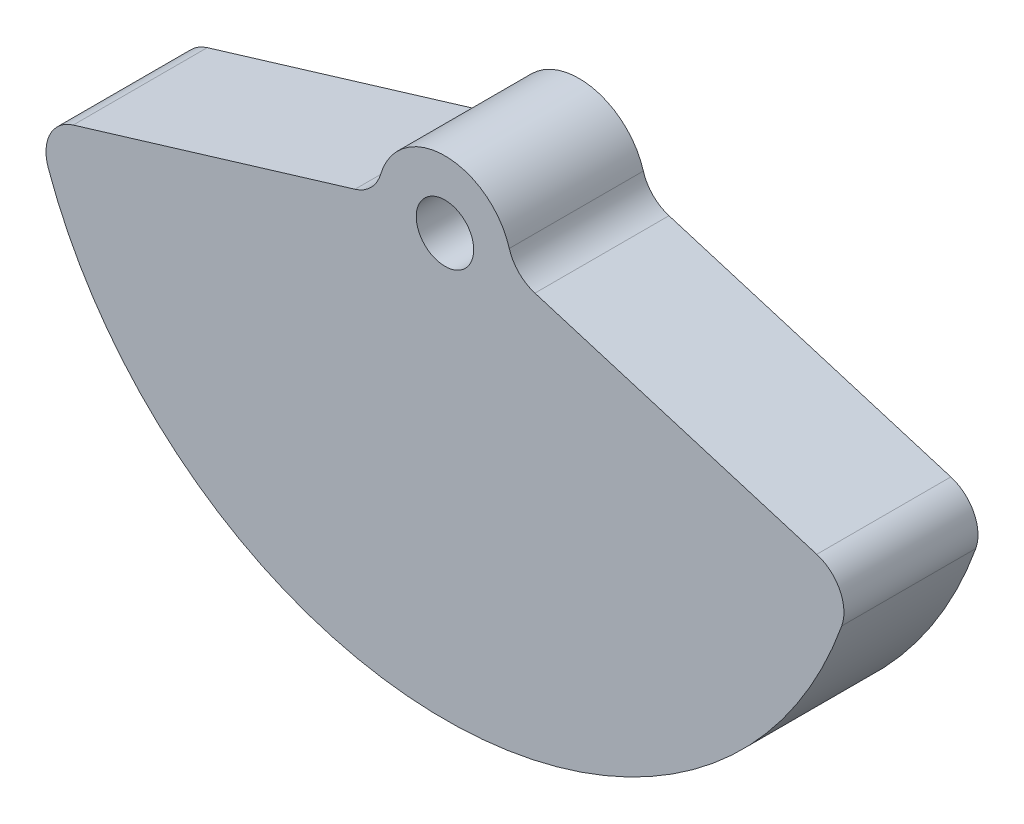
ISO-10303-21;
HEADER;
FILE_DESCRIPTION(('STEP AP214'),'2;1');
FILE_NAME('part.step','',(''),(''),'','','');
FILE_SCHEMA(('AUTOMOTIVE_DESIGN { 1 0 10303 214 1 1 1 1 }'));
ENDSEC;
DATA;
#1=APPLICATION_CONTEXT('core data for automotive mechanical design processes');
#2=APPLICATION_PROTOCOL_DEFINITION('international standard','automotive_design',2000,#1);
#3=PRODUCT_CONTEXT('',#1,'mechanical');
#4=PRODUCT('Part','Part','',(#3));
#5=PRODUCT_RELATED_PRODUCT_CATEGORY('part','',(#4));
#6=PRODUCT_DEFINITION_FORMATION('','',#4);
#7=PRODUCT_DEFINITION_CONTEXT('part definition',#1,'design');
#8=PRODUCT_DEFINITION('design','',#6,#7);
#9=PRODUCT_DEFINITION_SHAPE('','',#8);
#10=(LENGTH_UNIT() NAMED_UNIT(*) SI_UNIT(.MILLI.,.METRE.));
#11=(NAMED_UNIT(*) PLANE_ANGLE_UNIT() SI_UNIT($,.RADIAN.));
#12=(NAMED_UNIT(*) SI_UNIT($,.STERADIAN.) SOLID_ANGLE_UNIT());
#13=UNCERTAINTY_MEASURE_WITH_UNIT(LENGTH_MEASURE(1.E-05),#10,'distance_accuracy_value','');
#14=(GEOMETRIC_REPRESENTATION_CONTEXT(3) GLOBAL_UNCERTAINTY_ASSIGNED_CONTEXT((#13)) GLOBAL_UNIT_ASSIGNED_CONTEXT((#10,
#11,#12)) REPRESENTATION_CONTEXT('',''));
#15=CARTESIAN_POINT('',(0.,0.,0.));
#16=DIRECTION('',(0.,0.,1.));
#17=DIRECTION('',(1.,0.,0.));
#18=AXIS2_PLACEMENT_3D('',#15,#16,#17);
#19=CARTESIAN_POINT('',(5.58432736770412,1.64237283975204,3.70416666666667));
#20=DIRECTION('',(0.,0.,-1.));
#21=DIRECTION('',(-1.,0.,0.));
#22=AXIS2_PLACEMENT_3D('',#19,#20,#21);
#23=PLANE('',#22);
#24=CARTESIAN_POINT('',(5.58432736770412,1.64237283975204,3.70416666666667));
#25=DIRECTION('',(0.,0.,-1.));
#26=DIRECTION('',(-1.,0.,0.));
#27=AXIS2_PLACEMENT_3D('',#24,#25,#26);
#28=CIRCLE('',#27,2.11666666666667);
#29=CARTESIAN_POINT('',(4.971067319684,-0.383507189094712,3.70416666666667));
#30=VERTEX_POINT('',#29);
#31=CARTESIAN_POINT('',(3.55366287035717,1.04514635256948,3.70416666666667));
#32=VERTEX_POINT('',#31);
#33=EDGE_CURVE('E145',#30,#32,#28,.T.);
#34=ORIENTED_EDGE('',*,*,#33,.T.);
#35=CARTESIAN_POINT('',(0.,0.,3.70416666666667));
#36=DIRECTION('',(0.,0.,1.));
#37=DIRECTION('',(1.,0.,0.));
#38=AXIS2_PLACEMENT_3D('',#35,#36,#37);
#39=CIRCLE('',#38,3.70416666666667);
#40=CARTESIAN_POINT('',(-3.55366287035717,1.04514635256948,3.70416666666667));
#41=VERTEX_POINT('',#40);
#42=EDGE_CURVE('E93',#32,#41,#39,.T.);
#43=ORIENTED_EDGE('',*,*,#42,.T.);
#44=CARTESIAN_POINT('',(-5.58432736770412,1.64237283975204,3.70416666666667));
#45=DIRECTION('',(0.,0.,-1.));
#46=DIRECTION('',(1.,0.,0.));
#47=AXIS2_PLACEMENT_3D('',#44,#45,#46);
#48=CIRCLE('',#47,2.11666666666667);
#49=CARTESIAN_POINT('',(-4.971067319684,-0.383507189094713,3.70416666666667));
#50=VERTEX_POINT('',#49);
#51=EDGE_CURVE('E160',#41,#50,#48,.T.);
#52=ORIENTED_EDGE('',*,*,#51,.T.);
#53=DIRECTION('',(-0.957108675045711,-0.289729156544941,0.));
#54=VECTOR('',#53,1.);
#55=CARTESIAN_POINT('',(-20.5451073112575,-5.09797022594919,3.70416666666667));
#56=LINE('',#55,#54);
#57=CARTESIAN_POINT('',(-20.5451073112575,-5.09797022594919,3.70416666666667));
#58=VERTEX_POINT('',#57);
#59=EDGE_CURVE('E173',#50,#58,#56,.T.);
#60=ORIENTED_EDGE('',*,*,#59,.T.);
#61=CARTESIAN_POINT('',(-19.9318472632373,-7.12385025479595,3.70416666666667));
#62=DIRECTION('',(0.,0.,1.));
#63=DIRECTION('',(1.,0.,0.));
#64=AXIS2_PLACEMENT_3D('',#61,#62,#63);
#65=CIRCLE('',#64,2.11666666666666);
#66=CARTESIAN_POINT('',(-21.9250319895611,-7.83623528027554,3.70416666666667));
#67=VERTEX_POINT('',#66);
#68=EDGE_CURVE('E112',#58,#67,#65,.T.);
#69=ORIENTED_EDGE('',*,*,#68,.T.);
#70=CARTESIAN_POINT('',(0.,0.,3.70416666666667));
#71=DIRECTION('',(0.,0.,1.));
#72=DIRECTION('',(1.,0.,0.));
#73=AXIS2_PLACEMENT_3D('',#70,#71,#72);
#74=CIRCLE('',#73,23.2833333333333);
#75=CARTESIAN_POINT('',(21.9250319895611,-7.83623528027554,3.70416666666667));
#76=VERTEX_POINT('',#75);
#77=EDGE_CURVE('E106',#67,#76,#74,.T.);
#78=ORIENTED_EDGE('',*,*,#77,.T.);
#79=CARTESIAN_POINT('',(19.9318472632373,-7.12385025479594,3.70416666666667));
#80=DIRECTION('',(0.,0.,1.));
#81=DIRECTION('',(-1.,0.,0.));
#82=AXIS2_PLACEMENT_3D('',#79,#80,#81);
#83=CIRCLE('',#82,2.11666666666666);
#84=CARTESIAN_POINT('',(20.5451073112575,-5.09797022594918,3.70416666666667));
#85=VERTEX_POINT('',#84);
#86=EDGE_CURVE('E110',#76,#85,#83,.T.);
#87=ORIENTED_EDGE('',*,*,#86,.T.);
#88=DIRECTION('',(-0.957108675045711,0.289729156544941,0.));
#89=VECTOR('',#88,1.);
#90=CARTESIAN_POINT('',(4.971067319684,-0.383507189094712,3.70416666666667));
#91=LINE('',#90,#89);
#92=EDGE_CURVE('E50',#85,#30,#91,.T.);
#93=ORIENTED_EDGE('',*,*,#92,.T.);
#94=EDGE_LOOP('',(#34,#43,#52,#60,#69,#78,#87,#93));
#95=FACE_BOUND('',#94,.T.);
#96=CARTESIAN_POINT('',(0.,0.,3.70416666666667));
#97=DIRECTION('',(0.,0.,1.));
#98=DIRECTION('',(1.,0.,0.));
#99=AXIS2_PLACEMENT_3D('',#96,#97,#98);
#100=CIRCLE('',#99,1.5875);
#101=CARTESIAN_POINT('',(1.5875,0.,3.70416666666667));
#102=VERTEX_POINT('',#101);
#103=EDGE_CURVE('E134',#102,#102,#100,.T.);
#104=ORIENTED_EDGE('',*,*,#103,.F.);
#105=EDGE_LOOP('',(#104));
#106=FACE_BOUND('',#105,.T.);
#107=ADVANCED_FACE('F33',(#95,#106),#23,.F.);
#108=CARTESIAN_POINT('',(5.58432736770412,1.64237283975204,-3.70416666666667));
#109=DIRECTION('',(0.,0.,-1.));
#110=DIRECTION('',(-1.,0.,0.));
#111=AXIS2_PLACEMENT_3D('',#108,#109,#110);
#112=PLANE('',#111);
#113=CARTESIAN_POINT('',(5.58432736770412,1.64237283975204,-3.70416666666667));
#114=DIRECTION('',(0.,0.,-1.));
#115=DIRECTION('',(-1.,0.,0.));
#116=AXIS2_PLACEMENT_3D('',#113,#114,#115);
#117=CIRCLE('',#116,2.11666666666667);
#118=CARTESIAN_POINT('',(4.971067319684,-0.383507189094712,-3.70416666666667));
#119=VERTEX_POINT('',#118);
#120=CARTESIAN_POINT('',(3.55366287035717,1.04514635256948,-3.70416666666667));
#121=VERTEX_POINT('',#120);
#122=EDGE_CURVE('E130',#119,#121,#117,.T.);
#123=ORIENTED_EDGE('',*,*,#122,.F.);
#124=DIRECTION('',(-0.957108675045711,0.289729156544941,0.));
#125=VECTOR('',#124,1.);
#126=CARTESIAN_POINT('',(4.971067319684,-0.383507189094712,-3.70416666666667));
#127=LINE('',#126,#125);
#128=CARTESIAN_POINT('',(20.5451073112575,-5.09797022594918,-3.70416666666667));
#129=VERTEX_POINT('',#128);
#130=EDGE_CURVE('E85',#129,#119,#127,.T.);
#131=ORIENTED_EDGE('',*,*,#130,.F.);
#132=CARTESIAN_POINT('',(19.9318472632373,-7.12385025479594,-3.70416666666667));
#133=DIRECTION('',(0.,0.,1.));
#134=DIRECTION('',(-1.,0.,0.));
#135=AXIS2_PLACEMENT_3D('',#132,#133,#134);
#136=CIRCLE('',#135,2.11666666666666);
#137=CARTESIAN_POINT('',(21.9250319895611,-7.83623528027554,-3.70416666666667));
#138=VERTEX_POINT('',#137);
#139=EDGE_CURVE('E79',#138,#129,#136,.T.);
#140=ORIENTED_EDGE('',*,*,#139,.F.);
#141=CARTESIAN_POINT('',(0.,0.,-3.70416666666667));
#142=DIRECTION('',(0.,0.,1.));
#143=DIRECTION('',(1.,0.,0.));
#144=AXIS2_PLACEMENT_3D('',#141,#142,#143);
#145=CIRCLE('',#144,23.2833333333333);
#146=CARTESIAN_POINT('',(-21.9250319895611,-7.83623528027554,-3.70416666666667));
#147=VERTEX_POINT('',#146);
#148=EDGE_CURVE('E120',#147,#138,#145,.T.);
#149=ORIENTED_EDGE('',*,*,#148,.F.);
#150=CARTESIAN_POINT('',(-19.9318472632373,-7.12385025479595,-3.70416666666667));
#151=DIRECTION('',(0.,0.,1.));
#152=DIRECTION('',(1.,0.,0.));
#153=AXIS2_PLACEMENT_3D('',#150,#151,#152);
#154=CIRCLE('',#153,2.11666666666666);
#155=CARTESIAN_POINT('',(-20.5451073112575,-5.09797022594919,-3.70416666666667));
#156=VERTEX_POINT('',#155);
#157=EDGE_CURVE('E140',#156,#147,#154,.T.);
#158=ORIENTED_EDGE('',*,*,#157,.F.);
#159=DIRECTION('',(-0.957108675045711,-0.289729156544941,0.));
#160=VECTOR('',#159,1.);
#161=CARTESIAN_POINT('',(-20.5451073112575,-5.09797022594919,-3.70416666666667));
#162=LINE('',#161,#160);
#163=CARTESIAN_POINT('',(-4.971067319684,-0.383507189094713,-3.70416666666667));
#164=VERTEX_POINT('',#163);
#165=EDGE_CURVE('E138',#164,#156,#162,.T.);
#166=ORIENTED_EDGE('',*,*,#165,.F.);
#167=CARTESIAN_POINT('',(-5.58432736770412,1.64237283975204,-3.70416666666667));
#168=DIRECTION('',(0.,0.,-1.));
#169=DIRECTION('',(1.,0.,0.));
#170=AXIS2_PLACEMENT_3D('',#167,#168,#169);
#171=CIRCLE('',#170,2.11666666666667);
#172=CARTESIAN_POINT('',(-3.55366287035717,1.04514635256948,-3.70416666666667));
#173=VERTEX_POINT('',#172);
#174=EDGE_CURVE('E136',#173,#164,#171,.T.);
#175=ORIENTED_EDGE('',*,*,#174,.F.);
#176=CARTESIAN_POINT('',(0.,0.,-3.70416666666667));
#177=DIRECTION('',(0.,0.,1.));
#178=DIRECTION('',(1.,0.,0.));
#179=AXIS2_PLACEMENT_3D('',#176,#177,#178);
#180=CIRCLE('',#179,3.70416666666667);
#181=EDGE_CURVE('E133',#121,#173,#180,.T.);
#182=ORIENTED_EDGE('',*,*,#181,.F.);
#183=EDGE_LOOP('',(#123,#131,#140,#149,#158,#166,#175,#182));
#184=FACE_BOUND('',#183,.T.);
#185=CARTESIAN_POINT('',(0.,0.,-3.70416666666667));
#186=DIRECTION('',(0.,0.,1.));
#187=DIRECTION('',(1.,0.,0.));
#188=AXIS2_PLACEMENT_3D('',#185,#186,#187);
#189=CIRCLE('',#188,1.5875);
#190=CARTESIAN_POINT('',(1.5875,0.,-3.70416666666667));
#191=VERTEX_POINT('',#190);
#192=EDGE_CURVE('E179',#191,#191,#189,.T.);
#193=ORIENTED_EDGE('',*,*,#192,.T.);
#194=EDGE_LOOP('',(#193));
#195=FACE_BOUND('',#194,.T.);
#196=ADVANCED_FACE('F164',(#184,#195),#112,.T.);
#197=CARTESIAN_POINT('',(5.58432736770412,1.64237283975204,3.70416666666667));
#198=DIRECTION('',(0.,0.,-1.));
#199=DIRECTION('',(-1.,0.,0.));
#200=AXIS2_PLACEMENT_3D('',#197,#198,#199);
#201=CYLINDRICAL_SURFACE('',#200,2.11666666666667);
#202=ORIENTED_EDGE('',*,*,#122,.T.);
#203=DIRECTION('',(0.,0.,-1.));
#204=VECTOR('',#203,1.);
#205=CARTESIAN_POINT('',(3.55366287035717,1.04514635256948,3.70416666666667));
#206=LINE('',#205,#204);
#207=EDGE_CURVE('E11',#32,#121,#206,.T.);
#208=ORIENTED_EDGE('',*,*,#207,.F.);
#209=ORIENTED_EDGE('',*,*,#33,.F.);
#210=DIRECTION('',(0.,0.,-1.));
#211=VECTOR('',#210,1.);
#212=CARTESIAN_POINT('',(4.971067319684,-0.383507189094712,3.70416666666667));
#213=LINE('',#212,#211);
#214=EDGE_CURVE('E126',#30,#119,#213,.T.);
#215=ORIENTED_EDGE('',*,*,#214,.T.);
#216=EDGE_LOOP('',(#202,#208,#209,#215));
#217=FACE_BOUND('',#216,.T.);
#218=ADVANCED_FACE('F35',(#217),#201,.F.);
#219=CARTESIAN_POINT('',(0.,0.,3.70416666666667));
#220=DIRECTION('',(0.,0.,-1.));
#221=DIRECTION('',(-1.,0.,0.));
#222=AXIS2_PLACEMENT_3D('',#219,#220,#221);
#223=CYLINDRICAL_SURFACE('',#222,3.70416666666667);
#224=ORIENTED_EDGE('',*,*,#181,.T.);
#225=DIRECTION('',(0.,0.,-1.));
#226=VECTOR('',#225,1.);
#227=CARTESIAN_POINT('',(-3.55366287035717,1.04514635256948,3.70416666666667));
#228=LINE('',#227,#226);
#229=EDGE_CURVE('E42',#41,#173,#228,.T.);
#230=ORIENTED_EDGE('',*,*,#229,.F.);
#231=ORIENTED_EDGE('',*,*,#42,.F.);
#232=ORIENTED_EDGE('',*,*,#207,.T.);
#233=EDGE_LOOP('',(#224,#230,#231,#232));
#234=FACE_BOUND('',#233,.T.);
#235=ADVANCED_FACE('F207',(#234),#223,.T.);
#236=CARTESIAN_POINT('',(-5.58432736770412,1.64237283975204,3.70416666666667));
#237=DIRECTION('',(0.,0.,-1.));
#238=DIRECTION('',(-1.,0.,0.));
#239=AXIS2_PLACEMENT_3D('',#236,#237,#238);
#240=CYLINDRICAL_SURFACE('',#239,2.11666666666667);
#241=ORIENTED_EDGE('',*,*,#174,.T.);
#242=DIRECTION('',(0.,0.,-1.));
#243=VECTOR('',#242,1.);
#244=CARTESIAN_POINT('',(-4.971067319684,-0.383507189094713,3.70416666666667));
#245=LINE('',#244,#243);
#246=EDGE_CURVE('E152',#50,#164,#245,.T.);
#247=ORIENTED_EDGE('',*,*,#246,.F.);
#248=ORIENTED_EDGE('',*,*,#51,.F.);
#249=ORIENTED_EDGE('',*,*,#229,.T.);
#250=EDGE_LOOP('',(#241,#247,#248,#249));
#251=FACE_BOUND('',#250,.T.);
#252=ADVANCED_FACE('F158',(#251),#240,.F.);
#253=CARTESIAN_POINT('',(-20.5451073112575,-5.09797022594919,3.70416666666667));
#254=DIRECTION('',(0.289729156544941,-0.957108675045711,0.));
#255=DIRECTION('',(0.957108675045711,0.289729156544941,0.));
#256=AXIS2_PLACEMENT_3D('',#253,#254,#255);
#257=PLANE('',#256);
#258=ORIENTED_EDGE('',*,*,#165,.T.);
#259=DIRECTION('',(0.,0.,-1.));
#260=VECTOR('',#259,1.);
#261=CARTESIAN_POINT('',(-20.5451073112575,-5.09797022594919,3.70416666666667));
#262=LINE('',#261,#260);
#263=EDGE_CURVE('E149',#58,#156,#262,.T.);
#264=ORIENTED_EDGE('',*,*,#263,.F.);
#265=ORIENTED_EDGE('',*,*,#59,.F.);
#266=ORIENTED_EDGE('',*,*,#246,.T.);
#267=EDGE_LOOP('',(#258,#264,#265,#266));
#268=FACE_BOUND('',#267,.T.);
#269=ADVANCED_FACE('F169',(#268),#257,.F.);
#270=CARTESIAN_POINT('',(-19.9318472632373,-7.12385025479595,3.70416666666667));
#271=DIRECTION('',(0.,0.,-1.));
#272=DIRECTION('',(-1.,0.,0.));
#273=AXIS2_PLACEMENT_3D('',#270,#271,#272);
#274=CYLINDRICAL_SURFACE('',#273,2.11666666666666);
#275=ORIENTED_EDGE('',*,*,#157,.T.);
#276=DIRECTION('',(0.,0.,-1.));
#277=VECTOR('',#276,1.);
#278=CARTESIAN_POINT('',(-21.9250319895611,-7.83623528027554,3.70416666666667));
#279=LINE('',#278,#277);
#280=EDGE_CURVE('E121',#67,#147,#279,.T.);
#281=ORIENTED_EDGE('',*,*,#280,.F.);
#282=ORIENTED_EDGE('',*,*,#68,.F.);
#283=ORIENTED_EDGE('',*,*,#263,.T.);
#284=EDGE_LOOP('',(#275,#281,#282,#283));
#285=FACE_BOUND('',#284,.T.);
#286=ADVANCED_FACE('F172',(#285),#274,.T.);
#287=CARTESIAN_POINT('',(0.,0.,3.70416666666667));
#288=DIRECTION('',(0.,0.,-1.));
#289=DIRECTION('',(-1.,0.,0.));
#290=AXIS2_PLACEMENT_3D('',#287,#288,#289);
#291=CYLINDRICAL_SURFACE('',#290,23.2833333333333);
#292=ORIENTED_EDGE('',*,*,#148,.T.);
#293=DIRECTION('',(0.,0.,-1.));
#294=VECTOR('',#293,1.);
#295=CARTESIAN_POINT('',(21.9250319895611,-7.83623528027554,3.70416666666667));
#296=LINE('',#295,#294);
#297=EDGE_CURVE('E117',#76,#138,#296,.T.);
#298=ORIENTED_EDGE('',*,*,#297,.F.);
#299=ORIENTED_EDGE('',*,*,#77,.F.);
#300=ORIENTED_EDGE('',*,*,#280,.T.);
#301=EDGE_LOOP('',(#292,#298,#299,#300));
#302=FACE_BOUND('',#301,.T.);
#303=ADVANCED_FACE('F118',(#302),#291,.T.);
#304=CARTESIAN_POINT('',(19.9318472632373,-7.12385025479594,3.70416666666667));
#305=DIRECTION('',(0.,0.,-1.));
#306=DIRECTION('',(-1.,0.,0.));
#307=AXIS2_PLACEMENT_3D('',#304,#305,#306);
#308=CYLINDRICAL_SURFACE('',#307,2.11666666666666);
#309=ORIENTED_EDGE('',*,*,#139,.T.);
#310=DIRECTION('',(0.,0.,-1.));
#311=VECTOR('',#310,1.);
#312=CARTESIAN_POINT('',(20.5451073112575,-5.09797022594918,3.70416666666667));
#313=LINE('',#312,#311);
#314=EDGE_CURVE('E122',#85,#129,#313,.T.);
#315=ORIENTED_EDGE('',*,*,#314,.F.);
#316=ORIENTED_EDGE('',*,*,#86,.F.);
#317=ORIENTED_EDGE('',*,*,#297,.T.);
#318=EDGE_LOOP('',(#309,#315,#316,#317));
#319=FACE_BOUND('',#318,.T.);
#320=ADVANCED_FACE('F124',(#319),#308,.T.);
#321=CARTESIAN_POINT('',(4.971067319684,-0.383507189094712,3.70416666666667));
#322=DIRECTION('',(-0.289729156544941,-0.957108675045711,0.));
#323=DIRECTION('',(0.957108675045711,-0.289729156544941,0.));
#324=AXIS2_PLACEMENT_3D('',#321,#322,#323);
#325=PLANE('',#324);
#326=ORIENTED_EDGE('',*,*,#130,.T.);
#327=ORIENTED_EDGE('',*,*,#214,.F.);
#328=ORIENTED_EDGE('',*,*,#92,.F.);
#329=ORIENTED_EDGE('',*,*,#314,.T.);
#330=EDGE_LOOP('',(#326,#327,#328,#329));
#331=FACE_BOUND('',#330,.T.);
#332=ADVANCED_FACE('F195',(#331),#325,.F.);
#333=CARTESIAN_POINT('',(0.,0.,3.70416666666667));
#334=DIRECTION('',(0.,0.,-1.));
#335=DIRECTION('',(-1.,0.,0.));
#336=AXIS2_PLACEMENT_3D('',#333,#334,#335);
#337=CYLINDRICAL_SURFACE('',#336,1.5875);
#338=ORIENTED_EDGE('',*,*,#103,.T.);
#339=EDGE_LOOP('',(#338));
#340=FACE_BOUND('',#339,.T.);
#341=ORIENTED_EDGE('',*,*,#192,.F.);
#342=EDGE_LOOP('',(#341));
#343=FACE_BOUND('',#342,.T.);
#344=ADVANCED_FACE('F185',(#340,#343),#337,.F.);
#345=CLOSED_SHELL('',(#107,#196,#218,#235,#252,#269,#286,#303,#320,#332,#344));
#346=MANIFOLD_SOLID_BREP('B2',#345);
#347=ADVANCED_BREP_SHAPE_REPRESENTATION('',(#18,#346),#14);
#348=SHAPE_DEFINITION_REPRESENTATION(#9,#347);
ENDSEC;
END-ISO-10303-21;
